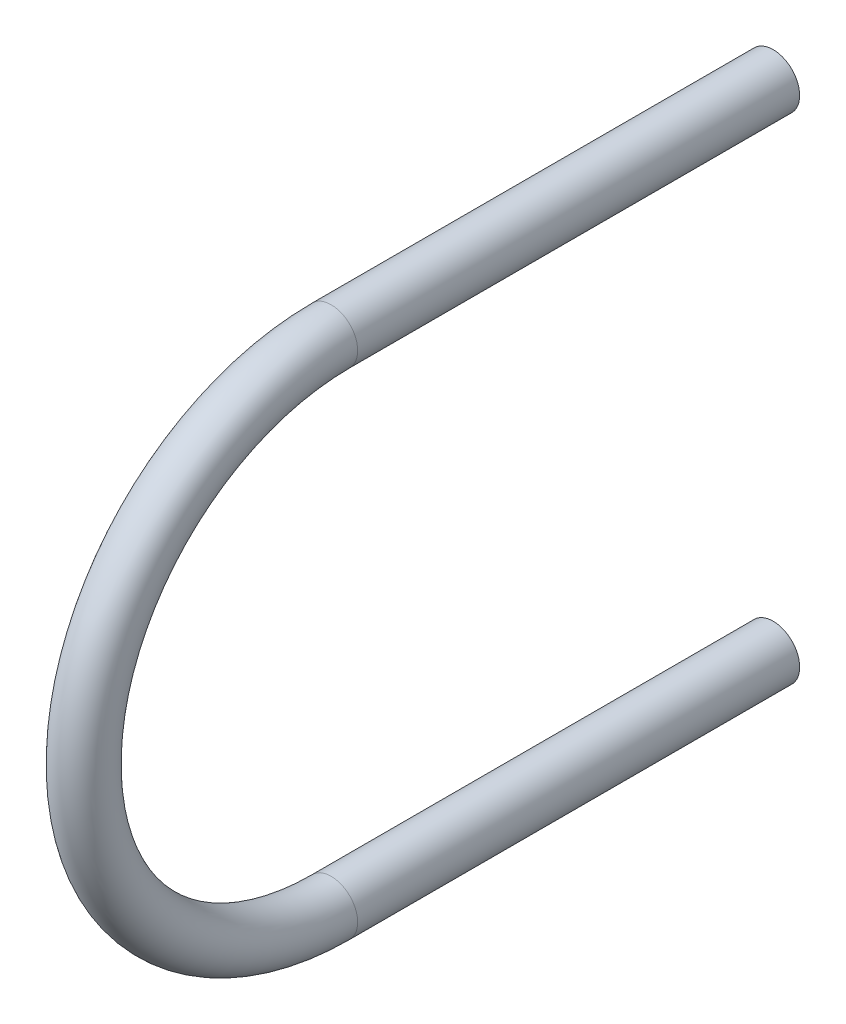
ISO-10303-21;
HEADER;
FILE_DESCRIPTION(('STEP AP214'),'2;1');
FILE_NAME('part.step','',(''),(''),'','','');
FILE_SCHEMA(('AUTOMOTIVE_DESIGN { 1 0 10303 214 1 1 1 1 }'));
ENDSEC;
DATA;
#1=APPLICATION_CONTEXT('core data for automotive mechanical design processes');
#2=APPLICATION_PROTOCOL_DEFINITION('international standard','automotive_design',2000,#1);
#3=PRODUCT_CONTEXT('',#1,'mechanical');
#4=PRODUCT('Part','Part','',(#3));
#5=PRODUCT_RELATED_PRODUCT_CATEGORY('part','',(#4));
#6=PRODUCT_DEFINITION_FORMATION('','',#4);
#7=PRODUCT_DEFINITION_CONTEXT('part definition',#1,'design');
#8=PRODUCT_DEFINITION('design','',#6,#7);
#9=PRODUCT_DEFINITION_SHAPE('','',#8);
#10=(LENGTH_UNIT() NAMED_UNIT(*) SI_UNIT(.MILLI.,.METRE.));
#11=(NAMED_UNIT(*) PLANE_ANGLE_UNIT() SI_UNIT($,.RADIAN.));
#12=(NAMED_UNIT(*) SI_UNIT($,.STERADIAN.) SOLID_ANGLE_UNIT());
#13=UNCERTAINTY_MEASURE_WITH_UNIT(LENGTH_MEASURE(1.E-05),#10,'distance_accuracy_value','');
#14=(GEOMETRIC_REPRESENTATION_CONTEXT(3) GLOBAL_UNCERTAINTY_ASSIGNED_CONTEXT((#13)) GLOBAL_UNIT_ASSIGNED_CONTEXT((#10,
#11,#12)) REPRESENTATION_CONTEXT('',''));
#15=CARTESIAN_POINT('',(0.,0.,0.));
#16=DIRECTION('',(0.,0.,1.));
#17=DIRECTION('',(1.,0.,0.));
#18=AXIS2_PLACEMENT_3D('',#15,#16,#17);
#19=CARTESIAN_POINT('',(0.,56.,-50.));
#20=DIRECTION('',(0.,0.,-1.));
#21=DIRECTION('',(1.,0.,0.));
#22=AXIS2_PLACEMENT_3D('',#19,#20,#21);
#23=PLANE('',#22);
#24=CARTESIAN_POINT('',(0.,56.,-50.));
#25=DIRECTION('',(0.,0.,-1.));
#26=DIRECTION('',(1.,0.,0.));
#27=AXIS2_PLACEMENT_3D('',#24,#25,#26);
#28=CIRCLE('',#27,3.);
#29=CARTESIAN_POINT('',(3.,56.,-50.));
#30=VERTEX_POINT('',#29);
#31=EDGE_CURVE('E63',#30,#30,#28,.T.);
#32=ORIENTED_EDGE('',*,*,#31,.T.);
#33=EDGE_LOOP('',(#32));
#34=FACE_BOUND('',#33,.T.);
#35=ADVANCED_FACE('F49',(#34),#23,.T.);
#36=CARTESIAN_POINT('',(0.,0.,-50.));
#37=DIRECTION('',(0.,0.,1.));
#38=DIRECTION('',(1.,0.,0.));
#39=AXIS2_PLACEMENT_3D('',#36,#37,#38);
#40=PLANE('',#39);
#41=CARTESIAN_POINT('',(0.,0.,-50.));
#42=DIRECTION('',(0.,0.,1.));
#43=DIRECTION('',(1.,0.,0.));
#44=AXIS2_PLACEMENT_3D('',#41,#42,#43);
#45=CIRCLE('',#44,3.);
#46=CARTESIAN_POINT('',(3.,0.,-50.));
#47=VERTEX_POINT('',#46);
#48=EDGE_CURVE('E11',#47,#47,#45,.T.);
#49=ORIENTED_EDGE('',*,*,#48,.F.);
#50=EDGE_LOOP('',(#49));
#51=FACE_BOUND('',#50,.T.);
#52=ADVANCED_FACE('F73',(#51),#40,.F.);
#53=CARTESIAN_POINT('',(0.,56.,-50.));
#54=DIRECTION('',(0.,0.,1.));
#55=DIRECTION('',(1.,0.,0.));
#56=AXIS2_PLACEMENT_3D('',#53,#54,#55);
#57=CYLINDRICAL_SURFACE('',#56,3.);
#58=CARTESIAN_POINT('',(0.,56.,0.));
#59=DIRECTION('',(0.,0.,-1.));
#60=DIRECTION('',(1.,0.,0.));
#61=AXIS2_PLACEMENT_3D('',#58,#59,#60);
#62=CIRCLE('',#61,3.);
#63=CARTESIAN_POINT('',(0.,59.,0.));
#64=VERTEX_POINT('',#63);
#65=EDGE_CURVE('E59',#64,#64,#62,.T.);
#66=ORIENTED_EDGE('',*,*,#65,.T.);
#67=EDGE_LOOP('',(#66));
#68=FACE_BOUND('',#67,.T.);
#69=ORIENTED_EDGE('',*,*,#31,.F.);
#70=EDGE_LOOP('',(#69));
#71=FACE_BOUND('',#70,.T.);
#72=ADVANCED_FACE('F70',(#68,#71),#57,.T.);
#73=CARTESIAN_POINT('',(0.,28.,0.));
#74=DIRECTION('',(1.,0.,0.));
#75=DIRECTION('',(0.,0.,-1.));
#76=AXIS2_PLACEMENT_3D('',#73,#74,#75);
#77=TOROIDAL_SURFACE('',#76,28.,3.);
#78=CARTESIAN_POINT('',(0.,0.,0.));
#79=DIRECTION('',(0.,0.,1.));
#80=DIRECTION('',(1.,0.,0.));
#81=AXIS2_PLACEMENT_3D('',#78,#79,#80);
#82=CIRCLE('',#81,3.);
#83=CARTESIAN_POINT('',(0.,-3.,0.));
#84=VERTEX_POINT('',#83);
#85=EDGE_CURVE('E55',#84,#84,#82,.T.);
#86=CARTESIAN_POINT('',(0.,28.,0.));
#87=DIRECTION('',(1.,0.,0.));
#88=DIRECTION('',(0.,0.,-1.));
#89=AXIS2_PLACEMENT_3D('',#86,#87,#88);
#90=CIRCLE('',#89,31.);
#91=EDGE_CURVE('',#64,#84,#90,.T.);
#92=ORIENTED_EDGE('',*,*,#65,.F.);
#93=ORIENTED_EDGE('',*,*,#85,.T.);
#94=ORIENTED_EDGE('',*,*,#91,.T.);
#95=ORIENTED_EDGE('',*,*,#91,.F.);
#96=EDGE_LOOP('',(#92,#94,#93,#95));
#97=FACE_BOUND('',#96,.T.);
#98=ADVANCED_FACE('F72',(#97),#77,.T.);
#99=CARTESIAN_POINT('',(0.,0.,0.));
#100=DIRECTION('',(0.,0.,-1.));
#101=DIRECTION('',(-1.,0.,0.));
#102=AXIS2_PLACEMENT_3D('',#99,#100,#101);
#103=CYLINDRICAL_SURFACE('',#102,3.);
#104=ORIENTED_EDGE('',*,*,#48,.T.);
#105=EDGE_LOOP('',(#104));
#106=FACE_BOUND('',#105,.T.);
#107=ORIENTED_EDGE('',*,*,#85,.F.);
#108=EDGE_LOOP('',(#107));
#109=FACE_BOUND('',#108,.T.);
#110=ADVANCED_FACE('F80',(#106,#109),#103,.T.);
#111=CLOSED_SHELL('',(#35,#52,#72,#98,#110));
#112=MANIFOLD_SOLID_BREP('B2',#111);
#113=ADVANCED_BREP_SHAPE_REPRESENTATION('',(#18,#112),#14);
#114=SHAPE_DEFINITION_REPRESENTATION(#9,#113);
ENDSEC;
END-ISO-10303-21;
